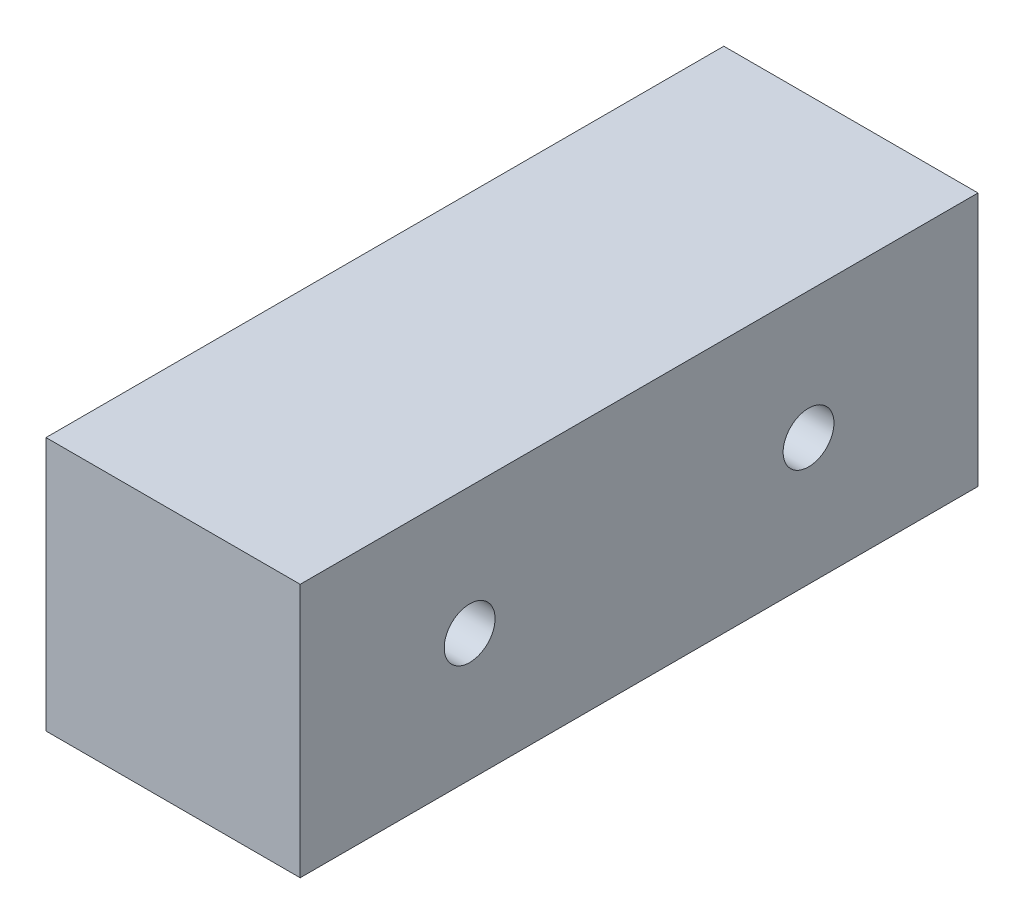
ISO-10303-21;
HEADER;
FILE_DESCRIPTION(('STEP AP214'),'2;1');
FILE_NAME('part.step','',(''),(''),'','','');
FILE_SCHEMA(('AUTOMOTIVE_DESIGN { 1 0 10303 214 1 1 1 1 }'));
ENDSEC;
DATA;
#1=APPLICATION_CONTEXT('core data for automotive mechanical design processes');
#2=APPLICATION_PROTOCOL_DEFINITION('international standard','automotive_design',2000,#1);
#3=PRODUCT_CONTEXT('',#1,'mechanical');
#4=PRODUCT('Part','Part','',(#3));
#5=PRODUCT_RELATED_PRODUCT_CATEGORY('part','',(#4));
#6=PRODUCT_DEFINITION_FORMATION('','',#4);
#7=PRODUCT_DEFINITION_CONTEXT('part definition',#1,'design');
#8=PRODUCT_DEFINITION('design','',#6,#7);
#9=PRODUCT_DEFINITION_SHAPE('','',#8);
#10=(LENGTH_UNIT() NAMED_UNIT(*) SI_UNIT(.MILLI.,.METRE.));
#11=(NAMED_UNIT(*) PLANE_ANGLE_UNIT() SI_UNIT($,.RADIAN.));
#12=(NAMED_UNIT(*) SI_UNIT($,.STERADIAN.) SOLID_ANGLE_UNIT());
#13=UNCERTAINTY_MEASURE_WITH_UNIT(LENGTH_MEASURE(1.E-05),#10,'distance_accuracy_value','');
#14=(GEOMETRIC_REPRESENTATION_CONTEXT(3) GLOBAL_UNCERTAINTY_ASSIGNED_CONTEXT((#13)) GLOBAL_UNIT_ASSIGNED_CONTEXT((#10,
#11,#12)) REPRESENTATION_CONTEXT('',''));
#15=CARTESIAN_POINT('',(0.,0.,0.));
#16=DIRECTION('',(0.,0.,1.));
#17=DIRECTION('',(1.,0.,0.));
#18=AXIS2_PLACEMENT_3D('',#15,#16,#17);
#19=CARTESIAN_POINT('',(0.,150.,0.));
#20=DIRECTION('',(1.,0.,0.));
#21=DIRECTION('',(0.,0.,-1.));
#22=AXIS2_PLACEMENT_3D('',#19,#20,#21);
#23=PLANE('',#22);
#24=CARTESIAN_POINT('',(0.,75.,-300.));
#25=DIRECTION('',(1.,0.,0.));
#26=DIRECTION('',(0.,0.,-1.));
#27=AXIS2_PLACEMENT_3D('',#24,#25,#26);
#28=CIRCLE('',#27,15.);
#29=CARTESIAN_POINT('',(0.,75.,-315.));
#30=VERTEX_POINT('',#29);
#31=EDGE_CURVE('E117',#30,#30,#28,.T.);
#32=ORIENTED_EDGE('',*,*,#31,.T.);
#33=EDGE_LOOP('',(#32));
#34=FACE_BOUND('',#33,.T.);
#35=CARTESIAN_POINT('',(0.,75.,-100.));
#36=DIRECTION('',(1.,0.,0.));
#37=DIRECTION('',(0.,0.,-1.));
#38=AXIS2_PLACEMENT_3D('',#35,#36,#37);
#39=CIRCLE('',#38,15.);
#40=CARTESIAN_POINT('',(0.,75.,-115.));
#41=VERTEX_POINT('',#40);
#42=EDGE_CURVE('E134',#41,#41,#39,.T.);
#43=ORIENTED_EDGE('',*,*,#42,.T.);
#44=EDGE_LOOP('',(#43));
#45=FACE_BOUND('',#44,.T.);
#46=DIRECTION('',(0.,0.,1.));
#47=VECTOR('',#46,1.);
#48=CARTESIAN_POINT('',(0.,0.,0.));
#49=LINE('',#48,#47);
#50=CARTESIAN_POINT('',(0.,0.,-400.));
#51=VERTEX_POINT('',#50);
#52=CARTESIAN_POINT('',(0.,0.,0.));
#53=VERTEX_POINT('',#52);
#54=EDGE_CURVE('E113',#51,#53,#49,.T.);
#55=ORIENTED_EDGE('',*,*,#54,.T.);
#56=DIRECTION('',(0.,-1.,0.));
#57=VECTOR('',#56,1.);
#58=CARTESIAN_POINT('',(0.,150.,0.));
#59=LINE('',#58,#57);
#60=CARTESIAN_POINT('',(0.,150.,0.));
#61=VERTEX_POINT('',#60);
#62=EDGE_CURVE('E11',#61,#53,#59,.T.);
#63=ORIENTED_EDGE('',*,*,#62,.F.);
#64=DIRECTION('',(0.,0.,1.));
#65=VECTOR('',#64,1.);
#66=CARTESIAN_POINT('',(0.,150.,0.));
#67=LINE('',#66,#65);
#68=CARTESIAN_POINT('',(0.,150.,-400.));
#69=VERTEX_POINT('',#68);
#70=EDGE_CURVE('E97',#69,#61,#67,.T.);
#71=ORIENTED_EDGE('',*,*,#70,.F.);
#72=DIRECTION('',(0.,-1.,0.));
#73=VECTOR('',#72,1.);
#74=CARTESIAN_POINT('',(0.,150.,-400.));
#75=LINE('',#74,#73);
#76=EDGE_CURVE('E109',#69,#51,#75,.T.);
#77=ORIENTED_EDGE('',*,*,#76,.T.);
#78=EDGE_LOOP('',(#55,#63,#71,#77));
#79=FACE_BOUND('',#78,.T.);
#80=ADVANCED_FACE('F45',(#34,#45,#79),#23,.F.);
#81=CARTESIAN_POINT('',(0.,150.,0.));
#82=DIRECTION('',(0.,0.,-1.));
#83=DIRECTION('',(-1.,0.,0.));
#84=AXIS2_PLACEMENT_3D('',#81,#82,#83);
#85=PLANE('',#84);
#86=DIRECTION('',(1.,0.,0.));
#87=VECTOR('',#86,1.);
#88=CARTESIAN_POINT('',(0.,0.,0.));
#89=LINE('',#88,#87);
#90=CARTESIAN_POINT('',(150.,0.,0.));
#91=VERTEX_POINT('',#90);
#92=EDGE_CURVE('E102',#53,#91,#89,.T.);
#93=ORIENTED_EDGE('',*,*,#92,.T.);
#94=DIRECTION('',(0.,-1.,0.));
#95=VECTOR('',#94,1.);
#96=CARTESIAN_POINT('',(150.,150.,0.));
#97=LINE('',#96,#95);
#98=CARTESIAN_POINT('',(150.,150.,0.));
#99=VERTEX_POINT('',#98);
#100=EDGE_CURVE('E54',#99,#91,#97,.T.);
#101=ORIENTED_EDGE('',*,*,#100,.F.);
#102=DIRECTION('',(1.,0.,0.));
#103=VECTOR('',#102,1.);
#104=CARTESIAN_POINT('',(0.,150.,0.));
#105=LINE('',#104,#103);
#106=EDGE_CURVE('E92',#61,#99,#105,.T.);
#107=ORIENTED_EDGE('',*,*,#106,.F.);
#108=ORIENTED_EDGE('',*,*,#62,.T.);
#109=EDGE_LOOP('',(#93,#101,#107,#108));
#110=FACE_BOUND('',#109,.T.);
#111=ADVANCED_FACE('F101',(#110),#85,.F.);
#112=CARTESIAN_POINT('',(150.,150.,0.));
#113=DIRECTION('',(-1.,0.,0.));
#114=DIRECTION('',(0.,0.,1.));
#115=AXIS2_PLACEMENT_3D('',#112,#113,#114);
#116=PLANE('',#115);
#117=CARTESIAN_POINT('',(150.,75.,-300.));
#118=DIRECTION('',(1.,0.,0.));
#119=DIRECTION('',(0.,0.,-1.));
#120=AXIS2_PLACEMENT_3D('',#117,#118,#119);
#121=CIRCLE('',#120,15.);
#122=CARTESIAN_POINT('',(150.,75.,-315.));
#123=VERTEX_POINT('',#122);
#124=EDGE_CURVE('E142',#123,#123,#121,.T.);
#125=ORIENTED_EDGE('',*,*,#124,.F.);
#126=EDGE_LOOP('',(#125));
#127=FACE_BOUND('',#126,.T.);
#128=CARTESIAN_POINT('',(150.,75.,-100.));
#129=DIRECTION('',(1.,0.,0.));
#130=DIRECTION('',(0.,0.,-1.));
#131=AXIS2_PLACEMENT_3D('',#128,#129,#130);
#132=CIRCLE('',#131,15.);
#133=CARTESIAN_POINT('',(150.,75.,-115.));
#134=VERTEX_POINT('',#133);
#135=EDGE_CURVE('E138',#134,#134,#132,.T.);
#136=ORIENTED_EDGE('',*,*,#135,.F.);
#137=EDGE_LOOP('',(#136));
#138=FACE_BOUND('',#137,.T.);
#139=DIRECTION('',(0.,0.,-1.));
#140=VECTOR('',#139,1.);
#141=CARTESIAN_POINT('',(150.,0.,0.));
#142=LINE('',#141,#140);
#143=CARTESIAN_POINT('',(150.,0.,-400.));
#144=VERTEX_POINT('',#143);
#145=EDGE_CURVE('E79',#91,#144,#142,.T.);
#146=ORIENTED_EDGE('',*,*,#145,.T.);
#147=DIRECTION('',(0.,-1.,0.));
#148=VECTOR('',#147,1.);
#149=CARTESIAN_POINT('',(150.,150.,-400.));
#150=LINE('',#149,#148);
#151=CARTESIAN_POINT('',(150.,150.,-400.));
#152=VERTEX_POINT('',#151);
#153=EDGE_CURVE('E104',#152,#144,#150,.T.);
#154=ORIENTED_EDGE('',*,*,#153,.F.);
#155=DIRECTION('',(0.,0.,-1.));
#156=VECTOR('',#155,1.);
#157=CARTESIAN_POINT('',(150.,150.,0.));
#158=LINE('',#157,#156);
#159=EDGE_CURVE('E95',#99,#152,#158,.T.);
#160=ORIENTED_EDGE('',*,*,#159,.F.);
#161=ORIENTED_EDGE('',*,*,#100,.T.);
#162=EDGE_LOOP('',(#146,#154,#160,#161));
#163=FACE_BOUND('',#162,.T.);
#164=ADVANCED_FACE('F105',(#127,#138,#163),#116,.F.);
#165=CARTESIAN_POINT('',(0.,150.,-400.));
#166=DIRECTION('',(0.,0.,1.));
#167=DIRECTION('',(1.,0.,0.));
#168=AXIS2_PLACEMENT_3D('',#165,#166,#167);
#169=PLANE('',#168);
#170=DIRECTION('',(-1.,0.,0.));
#171=VECTOR('',#170,1.);
#172=CARTESIAN_POINT('',(0.,0.,-400.));
#173=LINE('',#172,#171);
#174=EDGE_CURVE('E85',#144,#51,#173,.T.);
#175=ORIENTED_EDGE('',*,*,#174,.T.);
#176=ORIENTED_EDGE('',*,*,#76,.F.);
#177=DIRECTION('',(-1.,0.,0.));
#178=VECTOR('',#177,1.);
#179=CARTESIAN_POINT('',(0.,150.,-400.));
#180=LINE('',#179,#178);
#181=EDGE_CURVE('E62',#152,#69,#180,.T.);
#182=ORIENTED_EDGE('',*,*,#181,.F.);
#183=ORIENTED_EDGE('',*,*,#153,.T.);
#184=EDGE_LOOP('',(#175,#176,#182,#183));
#185=FACE_BOUND('',#184,.T.);
#186=ADVANCED_FACE('F127',(#185),#169,.F.);
#187=CARTESIAN_POINT('',(0.,150.,0.));
#188=DIRECTION('',(0.,-1.,0.));
#189=DIRECTION('',(0.,0.,-1.));
#190=AXIS2_PLACEMENT_3D('',#187,#188,#189);
#191=PLANE('',#190);
#192=ORIENTED_EDGE('',*,*,#70,.T.);
#193=ORIENTED_EDGE('',*,*,#106,.T.);
#194=ORIENTED_EDGE('',*,*,#159,.T.);
#195=ORIENTED_EDGE('',*,*,#181,.T.);
#196=EDGE_LOOP('',(#192,#193,#194,#195));
#197=FACE_BOUND('',#196,.T.);
#198=ADVANCED_FACE('F93',(#197),#191,.F.);
#199=CARTESIAN_POINT('',(0.,0.,0.));
#200=DIRECTION('',(0.,-1.,0.));
#201=DIRECTION('',(0.,0.,-1.));
#202=AXIS2_PLACEMENT_3D('',#199,#200,#201);
#203=PLANE('',#202);
#204=ORIENTED_EDGE('',*,*,#54,.F.);
#205=ORIENTED_EDGE('',*,*,#174,.F.);
#206=ORIENTED_EDGE('',*,*,#145,.F.);
#207=ORIENTED_EDGE('',*,*,#92,.F.);
#208=EDGE_LOOP('',(#204,#205,#206,#207));
#209=FACE_BOUND('',#208,.T.);
#210=ADVANCED_FACE('F130',(#209),#203,.T.);
#211=CARTESIAN_POINT('',(0.,75.,-100.));
#212=DIRECTION('',(1.,0.,0.));
#213=DIRECTION('',(0.,0.,-1.));
#214=AXIS2_PLACEMENT_3D('',#211,#212,#213);
#215=CYLINDRICAL_SURFACE('',#214,15.);
#216=ORIENTED_EDGE('',*,*,#42,.F.);
#217=EDGE_LOOP('',(#216));
#218=FACE_BOUND('',#217,.T.);
#219=ORIENTED_EDGE('',*,*,#135,.T.);
#220=EDGE_LOOP('',(#219));
#221=FACE_BOUND('',#220,.T.);
#222=ADVANCED_FACE('F155',(#218,#221),#215,.F.);
#223=CARTESIAN_POINT('',(0.,75.,-300.));
#224=DIRECTION('',(1.,0.,0.));
#225=DIRECTION('',(0.,0.,-1.));
#226=AXIS2_PLACEMENT_3D('',#223,#224,#225);
#227=CYLINDRICAL_SURFACE('',#226,15.);
#228=ORIENTED_EDGE('',*,*,#31,.F.);
#229=EDGE_LOOP('',(#228));
#230=FACE_BOUND('',#229,.T.);
#231=ORIENTED_EDGE('',*,*,#124,.T.);
#232=EDGE_LOOP('',(#231));
#233=FACE_BOUND('',#232,.T.);
#234=ADVANCED_FACE('F152',(#230,#233),#227,.F.);
#235=CLOSED_SHELL('',(#80,#111,#164,#186,#198,#210,#222,#234));
#236=MANIFOLD_SOLID_BREP('B2',#235);
#237=ADVANCED_BREP_SHAPE_REPRESENTATION('',(#18,#236),#14);
#238=SHAPE_DEFINITION_REPRESENTATION(#9,#237);
ENDSEC;
END-ISO-10303-21;
